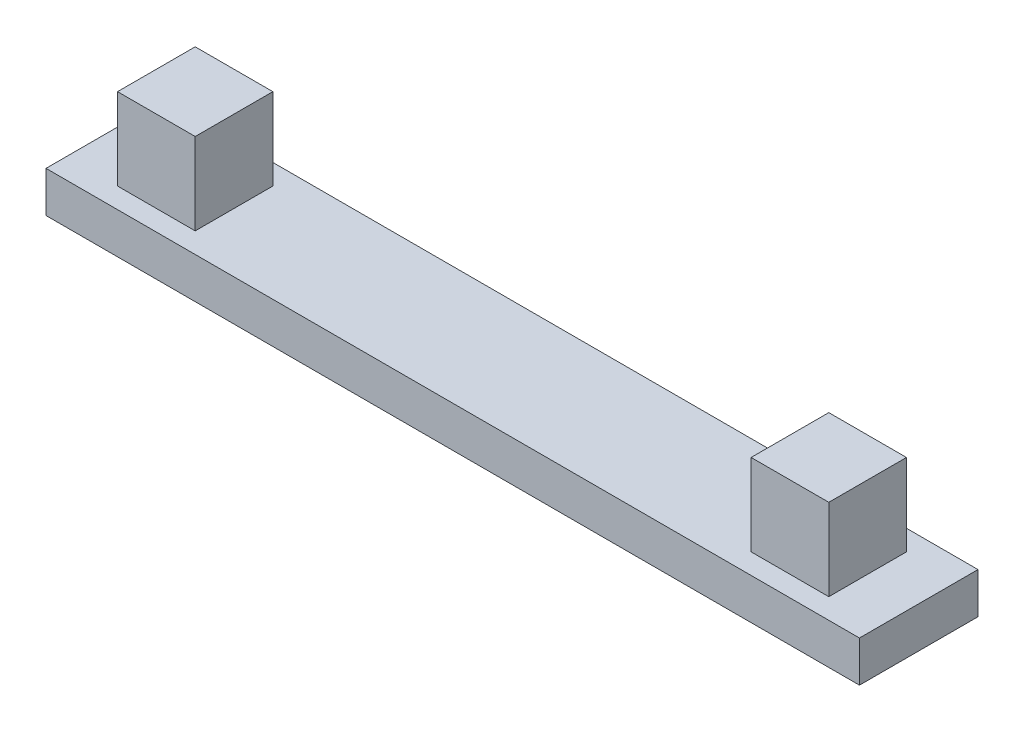
ISO-10303-21;
HEADER;
FILE_DESCRIPTION(('STEP AP214'),'2;1');
FILE_NAME('part.step','',(''),(''),'','','');
FILE_SCHEMA(('AUTOMOTIVE_DESIGN { 1 0 10303 214 1 1 1 1 }'));
ENDSEC;
DATA;
#1=APPLICATION_CONTEXT('core data for automotive mechanical design processes');
#2=APPLICATION_PROTOCOL_DEFINITION('international standard','automotive_design',2000,#1);
#3=PRODUCT_CONTEXT('',#1,'mechanical');
#4=PRODUCT('Part','Part','',(#3));
#5=PRODUCT_RELATED_PRODUCT_CATEGORY('part','',(#4));
#6=PRODUCT_DEFINITION_FORMATION('','',#4);
#7=PRODUCT_DEFINITION_CONTEXT('part definition',#1,'design');
#8=PRODUCT_DEFINITION('design','',#6,#7);
#9=PRODUCT_DEFINITION_SHAPE('','',#8);
#10=(LENGTH_UNIT() NAMED_UNIT(*) SI_UNIT(.MILLI.,.METRE.));
#11=(NAMED_UNIT(*) PLANE_ANGLE_UNIT() SI_UNIT($,.RADIAN.));
#12=(NAMED_UNIT(*) SI_UNIT($,.STERADIAN.) SOLID_ANGLE_UNIT());
#13=UNCERTAINTY_MEASURE_WITH_UNIT(LENGTH_MEASURE(1.E-05),#10,'distance_accuracy_value','');
#14=(GEOMETRIC_REPRESENTATION_CONTEXT(3) GLOBAL_UNCERTAINTY_ASSIGNED_CONTEXT((#13)) GLOBAL_UNIT_ASSIGNED_CONTEXT((#10,
#11,#12)) REPRESENTATION_CONTEXT('',''));
#15=CARTESIAN_POINT('',(0.,0.,0.));
#16=DIRECTION('',(0.,0.,1.));
#17=DIRECTION('',(1.,0.,0.));
#18=AXIS2_PLACEMENT_3D('',#15,#16,#17);
#19=CARTESIAN_POINT('',(0.,1.,0.));
#20=DIRECTION('',(0.,0.,-1.));
#21=DIRECTION('',(-1.,0.,0.));
#22=AXIS2_PLACEMENT_3D('',#19,#20,#21);
#23=PLANE('',#22);
#24=DIRECTION('',(1.,0.,0.));
#25=VECTOR('',#24,1.);
#26=CARTESIAN_POINT('',(0.,0.,0.));
#27=LINE('',#26,#25);
#28=CARTESIAN_POINT('',(0.,0.,0.));
#29=VERTEX_POINT('',#28);
#30=CARTESIAN_POINT('',(19.9,0.,0.));
#31=VERTEX_POINT('',#30);
#32=EDGE_CURVE('E138',#29,#31,#27,.T.);
#33=ORIENTED_EDGE('',*,*,#32,.T.);
#34=DIRECTION('',(0.,-1.,0.));
#35=VECTOR('',#34,1.);
#36=CARTESIAN_POINT('',(19.9,1.,0.));
#37=LINE('',#36,#35);
#38=CARTESIAN_POINT('',(19.9,1.,0.));
#39=VERTEX_POINT('',#38);
#40=EDGE_CURVE('E11',#39,#31,#37,.T.);
#41=ORIENTED_EDGE('',*,*,#40,.F.);
#42=DIRECTION('',(1.,0.,0.));
#43=VECTOR('',#42,1.);
#44=CARTESIAN_POINT('',(0.,1.,0.));
#45=LINE('',#44,#43);
#46=CARTESIAN_POINT('',(0.,1.,0.));
#47=VERTEX_POINT('',#46);
#48=EDGE_CURVE('E103',#47,#39,#45,.T.);
#49=ORIENTED_EDGE('',*,*,#48,.F.);
#50=DIRECTION('',(0.,-1.,0.));
#51=VECTOR('',#50,1.);
#52=CARTESIAN_POINT('',(0.,1.,0.));
#53=LINE('',#52,#51);
#54=EDGE_CURVE('E80',#47,#29,#53,.T.);
#55=ORIENTED_EDGE('',*,*,#54,.T.);
#56=EDGE_LOOP('',(#33,#41,#49,#55));
#57=FACE_BOUND('',#56,.T.);
#58=ADVANCED_FACE('F37',(#57),#23,.F.);
#59=CARTESIAN_POINT('',(19.9,1.,0.));
#60=DIRECTION('',(-1.,0.,0.));
#61=DIRECTION('',(0.,0.,1.));
#62=AXIS2_PLACEMENT_3D('',#59,#60,#61);
#63=PLANE('',#62);
#64=DIRECTION('',(0.,0.,-1.));
#65=VECTOR('',#64,1.);
#66=CARTESIAN_POINT('',(19.9,0.,0.));
#67=LINE('',#66,#65);
#68=CARTESIAN_POINT('',(19.9,0.,-2.9));
#69=VERTEX_POINT('',#68);
#70=EDGE_CURVE('E140',#31,#69,#67,.T.);
#71=ORIENTED_EDGE('',*,*,#70,.T.);
#72=DIRECTION('',(0.,-1.,0.));
#73=VECTOR('',#72,1.);
#74=CARTESIAN_POINT('',(19.9,1.,-2.9));
#75=LINE('',#74,#73);
#76=CARTESIAN_POINT('',(19.9,1.,-2.9));
#77=VERTEX_POINT('',#76);
#78=EDGE_CURVE('E45',#77,#69,#75,.T.);
#79=ORIENTED_EDGE('',*,*,#78,.F.);
#80=DIRECTION('',(0.,0.,-1.));
#81=VECTOR('',#80,1.);
#82=CARTESIAN_POINT('',(19.9,1.,0.));
#83=LINE('',#82,#81);
#84=EDGE_CURVE('E88',#39,#77,#83,.T.);
#85=ORIENTED_EDGE('',*,*,#84,.F.);
#86=ORIENTED_EDGE('',*,*,#40,.T.);
#87=EDGE_LOOP('',(#71,#79,#85,#86));
#88=FACE_BOUND('',#87,.T.);
#89=ADVANCED_FACE('F150',(#88),#63,.F.);
#90=CARTESIAN_POINT('',(0.,1.,-2.9));
#91=DIRECTION('',(0.,0.,-1.));
#92=DIRECTION('',(-1.,0.,0.));
#93=AXIS2_PLACEMENT_3D('',#90,#91,#92);
#94=PLANE('',#93);
#95=DIRECTION('',(1.,0.,0.));
#96=VECTOR('',#95,1.);
#97=CARTESIAN_POINT('',(0.,0.,-2.9));
#98=LINE('',#97,#96);
#99=CARTESIAN_POINT('',(0.,0.,-2.9));
#100=VERTEX_POINT('',#99);
#101=EDGE_CURVE('E144',#100,#69,#98,.T.);
#102=ORIENTED_EDGE('',*,*,#101,.F.);
#103=DIRECTION('',(0.,-1.,0.));
#104=VECTOR('',#103,1.);
#105=CARTESIAN_POINT('',(0.,1.,-2.9));
#106=LINE('',#105,#104);
#107=CARTESIAN_POINT('',(0.,1.,-2.9));
#108=VERTEX_POINT('',#107);
#109=EDGE_CURVE('E72',#108,#100,#106,.T.);
#110=ORIENTED_EDGE('',*,*,#109,.F.);
#111=DIRECTION('',(1.,0.,0.));
#112=VECTOR('',#111,1.);
#113=CARTESIAN_POINT('',(0.,1.,-2.9));
#114=LINE('',#113,#112);
#115=EDGE_CURVE('E110',#108,#77,#114,.T.);
#116=ORIENTED_EDGE('',*,*,#115,.T.);
#117=ORIENTED_EDGE('',*,*,#78,.T.);
#118=EDGE_LOOP('',(#102,#110,#116,#117));
#119=FACE_BOUND('',#118,.T.);
#120=ADVANCED_FACE('F149',(#119),#94,.T.);
#121=CARTESIAN_POINT('',(0.,1.,0.));
#122=DIRECTION('',(-1.,0.,0.));
#123=DIRECTION('',(0.,0.,1.));
#124=AXIS2_PLACEMENT_3D('',#121,#122,#123);
#125=PLANE('',#124);
#126=DIRECTION('',(0.,0.,-1.));
#127=VECTOR('',#126,1.);
#128=CARTESIAN_POINT('',(0.,0.,0.));
#129=LINE('',#128,#127);
#130=EDGE_CURVE('E99',#29,#100,#129,.T.);
#131=ORIENTED_EDGE('',*,*,#130,.F.);
#132=ORIENTED_EDGE('',*,*,#54,.F.);
#133=DIRECTION('',(0.,0.,-1.));
#134=VECTOR('',#133,1.);
#135=CARTESIAN_POINT('',(0.,1.,0.));
#136=LINE('',#135,#134);
#137=EDGE_CURVE('E97',#47,#108,#136,.T.);
#138=ORIENTED_EDGE('',*,*,#137,.T.);
#139=ORIENTED_EDGE('',*,*,#109,.T.);
#140=EDGE_LOOP('',(#131,#132,#138,#139));
#141=FACE_BOUND('',#140,.T.);
#142=ADVANCED_FACE('F95',(#141),#125,.T.);
#143=CARTESIAN_POINT('',(0.,1.,0.));
#144=DIRECTION('',(0.,1.,0.));
#145=DIRECTION('',(0.,0.,1.));
#146=AXIS2_PLACEMENT_3D('',#143,#144,#145);
#147=PLANE('',#146);
#148=ORIENTED_EDGE('',*,*,#48,.T.);
#149=ORIENTED_EDGE('',*,*,#84,.T.);
#150=ORIENTED_EDGE('',*,*,#115,.F.);
#151=ORIENTED_EDGE('',*,*,#137,.F.);
#152=EDGE_LOOP('',(#148,#149,#150,#151));
#153=FACE_BOUND('',#152,.T.);
#154=DIRECTION('',(1.,0.,0.));
#155=VECTOR('',#154,1.);
#156=CARTESIAN_POINT('',(0.,1.,-2.4));
#157=LINE('',#156,#155);
#158=CARTESIAN_POINT('',(1.25,1.,-2.4));
#159=VERTEX_POINT('',#158);
#160=CARTESIAN_POINT('',(3.15,1.,-2.4));
#161=VERTEX_POINT('',#160);
#162=EDGE_CURVE('E111',#159,#161,#157,.T.);
#163=ORIENTED_EDGE('',*,*,#162,.T.);
#164=DIRECTION('',(0.,0.,1.));
#165=VECTOR('',#164,1.);
#166=CARTESIAN_POINT('',(3.15,1.,0.));
#167=LINE('',#166,#165);
#168=CARTESIAN_POINT('',(3.15,1.,-0.5));
#169=VERTEX_POINT('',#168);
#170=EDGE_CURVE('E114',#161,#169,#167,.T.);
#171=ORIENTED_EDGE('',*,*,#170,.T.);
#172=DIRECTION('',(1.,0.,0.));
#173=VECTOR('',#172,1.);
#174=CARTESIAN_POINT('',(0.,1.,-0.5));
#175=LINE('',#174,#173);
#176=CARTESIAN_POINT('',(1.25,1.,-0.5));
#177=VERTEX_POINT('',#176);
#178=EDGE_CURVE('E121',#177,#169,#175,.T.);
#179=ORIENTED_EDGE('',*,*,#178,.F.);
#180=DIRECTION('',(0.,0.,1.));
#181=VECTOR('',#180,1.);
#182=CARTESIAN_POINT('',(1.25,1.,0.));
#183=LINE('',#182,#181);
#184=EDGE_CURVE('E124',#159,#177,#183,.T.);
#185=ORIENTED_EDGE('',*,*,#184,.F.);
#186=EDGE_LOOP('',(#163,#171,#179,#185));
#187=FACE_BOUND('',#186,.T.);
#188=DIRECTION('',(1.,0.,0.));
#189=VECTOR('',#188,1.);
#190=CARTESIAN_POINT('',(0.,1.,-2.4));
#191=LINE('',#190,#189);
#192=CARTESIAN_POINT('',(16.75,1.,-2.4));
#193=VERTEX_POINT('',#192);
#194=CARTESIAN_POINT('',(18.65,1.,-2.4));
#195=VERTEX_POINT('',#194);
#196=EDGE_CURVE('E127',#193,#195,#191,.T.);
#197=ORIENTED_EDGE('',*,*,#196,.T.);
#198=DIRECTION('',(0.,0.,1.));
#199=VECTOR('',#198,1.);
#200=CARTESIAN_POINT('',(18.65,1.,0.));
#201=LINE('',#200,#199);
#202=CARTESIAN_POINT('',(18.65,1.,-0.5));
#203=VERTEX_POINT('',#202);
#204=EDGE_CURVE('E130',#195,#203,#201,.T.);
#205=ORIENTED_EDGE('',*,*,#204,.T.);
#206=DIRECTION('',(1.,0.,0.));
#207=VECTOR('',#206,1.);
#208=CARTESIAN_POINT('',(0.,1.,-0.5));
#209=LINE('',#208,#207);
#210=CARTESIAN_POINT('',(16.75,1.,-0.5));
#211=VERTEX_POINT('',#210);
#212=EDGE_CURVE('E133',#211,#203,#209,.T.);
#213=ORIENTED_EDGE('',*,*,#212,.F.);
#214=DIRECTION('',(0.,0.,1.));
#215=VECTOR('',#214,1.);
#216=CARTESIAN_POINT('',(16.75,1.,0.));
#217=LINE('',#216,#215);
#218=EDGE_CURVE('E100',#193,#211,#217,.T.);
#219=ORIENTED_EDGE('',*,*,#218,.F.);
#220=EDGE_LOOP('',(#197,#205,#213,#219));
#221=FACE_BOUND('',#220,.T.);
#222=ADVANCED_FACE('F107',(#153,#187,#221),#147,.T.);
#223=CARTESIAN_POINT('',(0.,0.,0.));
#224=DIRECTION('',(0.,1.,0.));
#225=DIRECTION('',(0.,0.,1.));
#226=AXIS2_PLACEMENT_3D('',#223,#224,#225);
#227=PLANE('',#226);
#228=ORIENTED_EDGE('',*,*,#32,.F.);
#229=ORIENTED_EDGE('',*,*,#130,.T.);
#230=ORIENTED_EDGE('',*,*,#101,.T.);
#231=ORIENTED_EDGE('',*,*,#70,.F.);
#232=EDGE_LOOP('',(#228,#229,#230,#231));
#233=FACE_BOUND('',#232,.T.);
#234=ADVANCED_FACE('F152',(#233),#227,.F.);
#235=CARTESIAN_POINT('',(1.25,3.,-2.4));
#236=DIRECTION('',(1.,0.,0.));
#237=DIRECTION('',(0.,0.,-1.));
#238=AXIS2_PLACEMENT_3D('',#235,#236,#237);
#239=PLANE('',#238);
#240=ORIENTED_EDGE('',*,*,#184,.T.);
#241=DIRECTION('',(0.,-1.,0.));
#242=VECTOR('',#241,1.);
#243=CARTESIAN_POINT('',(1.25,3.,-0.5));
#244=LINE('',#243,#242);
#245=CARTESIAN_POINT('',(1.25,3.,-0.5));
#246=VERTEX_POINT('',#245);
#247=EDGE_CURVE('E141',#246,#177,#244,.T.);
#248=ORIENTED_EDGE('',*,*,#247,.F.);
#249=DIRECTION('',(0.,0.,1.));
#250=VECTOR('',#249,1.);
#251=CARTESIAN_POINT('',(1.25,3.,-2.4));
#252=LINE('',#251,#250);
#253=CARTESIAN_POINT('',(1.25,3.,-2.4));
#254=VERTEX_POINT('',#253);
#255=EDGE_CURVE('E303',#254,#246,#252,.T.);
#256=ORIENTED_EDGE('',*,*,#255,.F.);
#257=DIRECTION('',(0.,-1.,0.));
#258=VECTOR('',#257,1.);
#259=CARTESIAN_POINT('',(1.25,3.,-2.4));
#260=LINE('',#259,#258);
#261=EDGE_CURVE('E334',#254,#159,#260,.T.);
#262=ORIENTED_EDGE('',*,*,#261,.T.);
#263=EDGE_LOOP('',(#240,#248,#256,#262));
#264=FACE_BOUND('',#263,.T.);
#265=ADVANCED_FACE('F154',(#264),#239,.F.);
#266=CARTESIAN_POINT('',(1.25,3.,-0.5));
#267=DIRECTION('',(0.,0.,-1.));
#268=DIRECTION('',(-1.,0.,0.));
#269=AXIS2_PLACEMENT_3D('',#266,#267,#268);
#270=PLANE('',#269);
#271=ORIENTED_EDGE('',*,*,#178,.T.);
#272=DIRECTION('',(0.,-1.,0.));
#273=VECTOR('',#272,1.);
#274=CARTESIAN_POINT('',(3.15,3.,-0.5));
#275=LINE('',#274,#273);
#276=CARTESIAN_POINT('',(3.15,3.,-0.5));
#277=VERTEX_POINT('',#276);
#278=EDGE_CURVE('E339',#277,#169,#275,.T.);
#279=ORIENTED_EDGE('',*,*,#278,.F.);
#280=DIRECTION('',(1.,0.,0.));
#281=VECTOR('',#280,1.);
#282=CARTESIAN_POINT('',(1.25,3.,-0.5));
#283=LINE('',#282,#281);
#284=EDGE_CURVE('E325',#246,#277,#283,.T.);
#285=ORIENTED_EDGE('',*,*,#284,.F.);
#286=ORIENTED_EDGE('',*,*,#247,.T.);
#287=EDGE_LOOP('',(#271,#279,#285,#286));
#288=FACE_BOUND('',#287,.T.);
#289=ADVANCED_FACE('F160',(#288),#270,.F.);
#290=CARTESIAN_POINT('',(3.15,3.,-2.4));
#291=DIRECTION('',(1.,0.,0.));
#292=DIRECTION('',(0.,0.,-1.));
#293=AXIS2_PLACEMENT_3D('',#290,#291,#292);
#294=PLANE('',#293);
#295=ORIENTED_EDGE('',*,*,#278,.T.);
#296=ORIENTED_EDGE('',*,*,#170,.F.);
#297=DIRECTION('',(0.,-1.,0.));
#298=VECTOR('',#297,1.);
#299=CARTESIAN_POINT('',(3.15,3.,-2.4));
#300=LINE('',#299,#298);
#301=CARTESIAN_POINT('',(3.15,3.,-2.4));
#302=VERTEX_POINT('',#301);
#303=EDGE_CURVE('E337',#302,#161,#300,.T.);
#304=ORIENTED_EDGE('',*,*,#303,.F.);
#305=DIRECTION('',(0.,0.,1.));
#306=VECTOR('',#305,1.);
#307=CARTESIAN_POINT('',(3.15,3.,-2.4));
#308=LINE('',#307,#306);
#309=EDGE_CURVE('E328',#302,#277,#308,.T.);
#310=ORIENTED_EDGE('',*,*,#309,.T.);
#311=EDGE_LOOP('',(#295,#296,#304,#310));
#312=FACE_BOUND('',#311,.T.);
#313=ADVANCED_FACE('F203',(#312),#294,.T.);
#314=CARTESIAN_POINT('',(1.25,3.,-2.4));
#315=DIRECTION('',(0.,0.,-1.));
#316=DIRECTION('',(-1.,0.,0.));
#317=AXIS2_PLACEMENT_3D('',#314,#315,#316);
#318=PLANE('',#317);
#319=ORIENTED_EDGE('',*,*,#303,.T.);
#320=ORIENTED_EDGE('',*,*,#162,.F.);
#321=ORIENTED_EDGE('',*,*,#261,.F.);
#322=DIRECTION('',(1.,0.,0.));
#323=VECTOR('',#322,1.);
#324=CARTESIAN_POINT('',(1.25,3.,-2.4));
#325=LINE('',#324,#323);
#326=EDGE_CURVE('E331',#254,#302,#325,.T.);
#327=ORIENTED_EDGE('',*,*,#326,.T.);
#328=EDGE_LOOP('',(#319,#320,#321,#327));
#329=FACE_BOUND('',#328,.T.);
#330=ADVANCED_FACE('F213',(#329),#318,.T.);
#331=CARTESIAN_POINT('',(0.,3.,0.));
#332=DIRECTION('',(0.,1.,0.));
#333=DIRECTION('',(0.,0.,1.));
#334=AXIS2_PLACEMENT_3D('',#331,#332,#333);
#335=PLANE('',#334);
#336=ORIENTED_EDGE('',*,*,#255,.T.);
#337=ORIENTED_EDGE('',*,*,#284,.T.);
#338=ORIENTED_EDGE('',*,*,#309,.F.);
#339=ORIENTED_EDGE('',*,*,#326,.F.);
#340=EDGE_LOOP('',(#336,#337,#338,#339));
#341=FACE_BOUND('',#340,.T.);
#342=ADVANCED_FACE('F223',(#341),#335,.T.);
#343=CARTESIAN_POINT('',(16.75,3.,-2.4));
#344=DIRECTION('',(1.,0.,0.));
#345=DIRECTION('',(0.,0.,-1.));
#346=AXIS2_PLACEMENT_3D('',#343,#344,#345);
#347=PLANE('',#346);
#348=ORIENTED_EDGE('',*,*,#218,.T.);
#349=DIRECTION('',(0.,-1.,0.));
#350=VECTOR('',#349,1.);
#351=CARTESIAN_POINT('',(16.75,3.,-0.5));
#352=LINE('',#351,#350);
#353=CARTESIAN_POINT('',(16.75,3.,-0.5));
#354=VERTEX_POINT('',#353);
#355=EDGE_CURVE('E306',#354,#211,#352,.T.);
#356=ORIENTED_EDGE('',*,*,#355,.F.);
#357=DIRECTION('',(0.,0.,1.));
#358=VECTOR('',#357,1.);
#359=CARTESIAN_POINT('',(16.75,3.,-2.4));
#360=LINE('',#359,#358);
#361=CARTESIAN_POINT('',(16.75,3.,-2.4));
#362=VERTEX_POINT('',#361);
#363=EDGE_CURVE('E291',#362,#354,#360,.T.);
#364=ORIENTED_EDGE('',*,*,#363,.F.);
#365=DIRECTION('',(0.,-1.,0.));
#366=VECTOR('',#365,1.);
#367=CARTESIAN_POINT('',(16.75,3.,-2.4));
#368=LINE('',#367,#366);
#369=EDGE_CURVE('E316',#362,#193,#368,.T.);
#370=ORIENTED_EDGE('',*,*,#369,.T.);
#371=EDGE_LOOP('',(#348,#356,#364,#370));
#372=FACE_BOUND('',#371,.T.);
#373=ADVANCED_FACE('F233',(#372),#347,.F.);
#374=CARTESIAN_POINT('',(16.75,3.,-0.5));
#375=DIRECTION('',(0.,0.,-1.));
#376=DIRECTION('',(-1.,0.,0.));
#377=AXIS2_PLACEMENT_3D('',#374,#375,#376);
#378=PLANE('',#377);
#379=ORIENTED_EDGE('',*,*,#212,.T.);
#380=DIRECTION('',(0.,-1.,0.));
#381=VECTOR('',#380,1.);
#382=CARTESIAN_POINT('',(18.65,3.,-0.5));
#383=LINE('',#382,#381);
#384=CARTESIAN_POINT('',(18.65,3.,-0.5));
#385=VERTEX_POINT('',#384);
#386=EDGE_CURVE('E310',#385,#203,#383,.T.);
#387=ORIENTED_EDGE('',*,*,#386,.F.);
#388=DIRECTION('',(1.,0.,0.));
#389=VECTOR('',#388,1.);
#390=CARTESIAN_POINT('',(16.75,3.,-0.5));
#391=LINE('',#390,#389);
#392=EDGE_CURVE('E296',#354,#385,#391,.T.);
#393=ORIENTED_EDGE('',*,*,#392,.F.);
#394=ORIENTED_EDGE('',*,*,#355,.T.);
#395=EDGE_LOOP('',(#379,#387,#393,#394));
#396=FACE_BOUND('',#395,.T.);
#397=ADVANCED_FACE('F243',(#396),#378,.F.);
#398=CARTESIAN_POINT('',(18.65,3.,-2.4));
#399=DIRECTION('',(1.,0.,0.));
#400=DIRECTION('',(0.,0.,-1.));
#401=AXIS2_PLACEMENT_3D('',#398,#399,#400);
#402=PLANE('',#401);
#403=ORIENTED_EDGE('',*,*,#386,.T.);
#404=ORIENTED_EDGE('',*,*,#204,.F.);
#405=DIRECTION('',(0.,-1.,0.));
#406=VECTOR('',#405,1.);
#407=CARTESIAN_POINT('',(18.65,3.,-2.4));
#408=LINE('',#407,#406);
#409=CARTESIAN_POINT('',(18.65,3.,-2.4));
#410=VERTEX_POINT('',#409);
#411=EDGE_CURVE('E53',#410,#195,#408,.T.);
#412=ORIENTED_EDGE('',*,*,#411,.F.);
#413=DIRECTION('',(0.,0.,1.));
#414=VECTOR('',#413,1.);
#415=CARTESIAN_POINT('',(18.65,3.,-2.4));
#416=LINE('',#415,#414);
#417=EDGE_CURVE('E319',#410,#385,#416,.T.);
#418=ORIENTED_EDGE('',*,*,#417,.T.);
#419=EDGE_LOOP('',(#403,#404,#412,#418));
#420=FACE_BOUND('',#419,.T.);
#421=ADVANCED_FACE('F253',(#420),#402,.T.);
#422=CARTESIAN_POINT('',(16.75,3.,-2.4));
#423=DIRECTION('',(0.,0.,-1.));
#424=DIRECTION('',(-1.,0.,0.));
#425=AXIS2_PLACEMENT_3D('',#422,#423,#424);
#426=PLANE('',#425);
#427=ORIENTED_EDGE('',*,*,#411,.T.);
#428=ORIENTED_EDGE('',*,*,#196,.F.);
#429=ORIENTED_EDGE('',*,*,#369,.F.);
#430=DIRECTION('',(1.,0.,0.));
#431=VECTOR('',#430,1.);
#432=CARTESIAN_POINT('',(16.75,3.,-2.4));
#433=LINE('',#432,#431);
#434=EDGE_CURVE('E299',#362,#410,#433,.T.);
#435=ORIENTED_EDGE('',*,*,#434,.T.);
#436=EDGE_LOOP('',(#427,#428,#429,#435));
#437=FACE_BOUND('',#436,.T.);
#438=ADVANCED_FACE('F263',(#437),#426,.T.);
#439=CARTESIAN_POINT('',(0.,3.,0.));
#440=DIRECTION('',(0.,1.,0.));
#441=DIRECTION('',(0.,0.,1.));
#442=AXIS2_PLACEMENT_3D('',#439,#440,#441);
#443=PLANE('',#442);
#444=ORIENTED_EDGE('',*,*,#363,.T.);
#445=ORIENTED_EDGE('',*,*,#392,.T.);
#446=ORIENTED_EDGE('',*,*,#417,.F.);
#447=ORIENTED_EDGE('',*,*,#434,.F.);
#448=EDGE_LOOP('',(#444,#445,#446,#447));
#449=FACE_BOUND('',#448,.T.);
#450=ADVANCED_FACE('F273',(#449),#443,.T.);
#451=CLOSED_SHELL('',(#58,#89,#120,#142,#222,#234,#265,#289,#313,#330,#342,#373,#397,#421,#438,#450));
#452=MANIFOLD_SOLID_BREP('B2',#451);
#453=ADVANCED_BREP_SHAPE_REPRESENTATION('',(#18,#452),#14);
#454=SHAPE_DEFINITION_REPRESENTATION(#9,#453);
ENDSEC;
END-ISO-10303-21;
